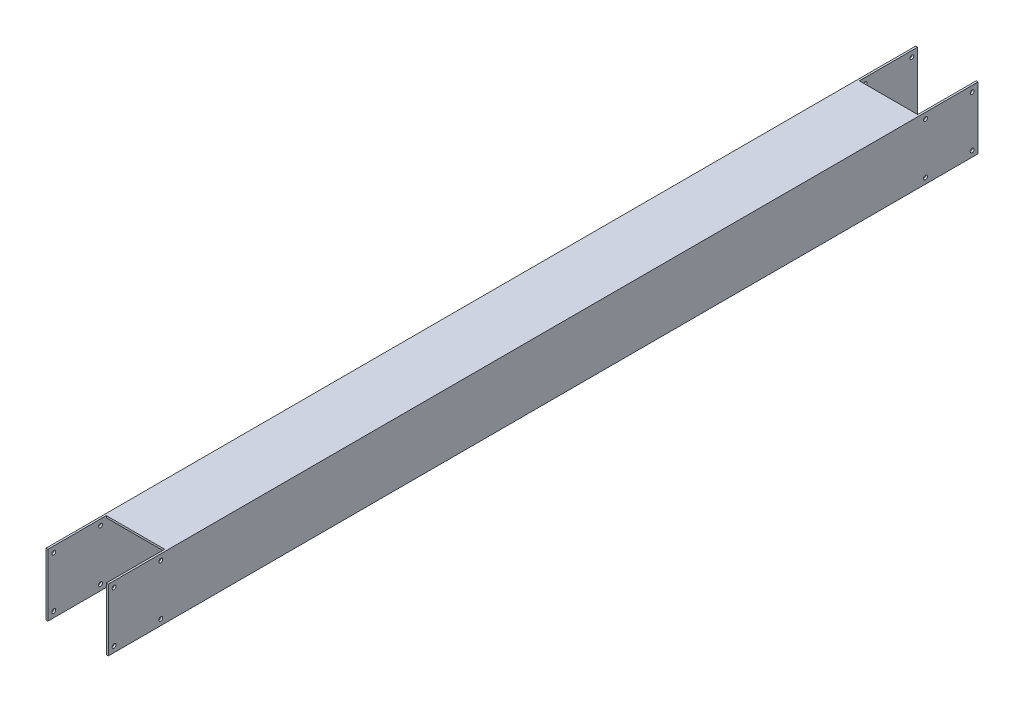
ISO-10303-21;
HEADER;
FILE_DESCRIPTION(('STEP AP214'),'2;1');
FILE_NAME('part.step','',(''),(''),'','','');
FILE_SCHEMA(('AUTOMOTIVE_DESIGN { 1 0 10303 214 1 1 1 1 }'));
ENDSEC;
DATA;
#1=APPLICATION_CONTEXT('core data for automotive mechanical design processes');
#2=APPLICATION_PROTOCOL_DEFINITION('international standard','automotive_design',2000,#1);
#3=PRODUCT_CONTEXT('',#1,'mechanical');
#4=PRODUCT('Part','Part','',(#3));
#5=PRODUCT_RELATED_PRODUCT_CATEGORY('part','',(#4));
#6=PRODUCT_DEFINITION_FORMATION('','',#4);
#7=PRODUCT_DEFINITION_CONTEXT('part definition',#1,'design');
#8=PRODUCT_DEFINITION('design','',#6,#7);
#9=PRODUCT_DEFINITION_SHAPE('','',#8);
#10=(LENGTH_UNIT() NAMED_UNIT(*) SI_UNIT(.MILLI.,.METRE.));
#11=(NAMED_UNIT(*) PLANE_ANGLE_UNIT() SI_UNIT($,.RADIAN.));
#12=(NAMED_UNIT(*) SI_UNIT($,.STERADIAN.) SOLID_ANGLE_UNIT());
#13=UNCERTAINTY_MEASURE_WITH_UNIT(LENGTH_MEASURE(1.E-05),#10,'distance_accuracy_value','');
#14=(GEOMETRIC_REPRESENTATION_CONTEXT(3) GLOBAL_UNCERTAINTY_ASSIGNED_CONTEXT((#13)) GLOBAL_UNIT_ASSIGNED_CONTEXT((#10,
#11,#12)) REPRESENTATION_CONTEXT('',''));
#15=CARTESIAN_POINT('',(0.,0.,0.));
#16=DIRECTION('',(0.,0.,1.));
#17=DIRECTION('',(1.,0.,0.));
#18=AXIS2_PLACEMENT_3D('',#15,#16,#17);
#19=CARTESIAN_POINT('',(-150.,-150.000000000001,4470.));
#20=DIRECTION('',(0.,1.,0.));
#21=DIRECTION('',(0.,0.,1.));
#22=AXIS2_PLACEMENT_3D('',#19,#20,#21);
#23=PLANE('',#22);
#24=DIRECTION('',(0.,0.,-1.));
#25=VECTOR('',#24,1.);
#26=CARTESIAN_POINT('',(150.,-150.000000000001,4470.));
#27=LINE('',#26,#25);
#28=CARTESIAN_POINT('',(150.,-150.000000000001,4170.));
#29=VERTEX_POINT('',#28);
#30=CARTESIAN_POINT('',(150.,-150.000000000001,300.));
#31=VERTEX_POINT('',#30);
#32=EDGE_CURVE('E335',#29,#31,#27,.T.);
#33=ORIENTED_EDGE('',*,*,#32,.T.);
#34=DIRECTION('',(-1.,0.,0.));
#35=VECTOR('',#34,1.);
#36=CARTESIAN_POINT('',(-150.,-150.000000000001,300.));
#37=LINE('',#36,#35);
#38=CARTESIAN_POINT('',(-150.,-150.000000000001,300.));
#39=VERTEX_POINT('',#38);
#40=EDGE_CURVE('E263',#31,#39,#37,.T.);
#41=ORIENTED_EDGE('',*,*,#40,.T.);
#42=DIRECTION('',(0.,0.,-1.));
#43=VECTOR('',#42,1.);
#44=CARTESIAN_POINT('',(-150.,-150.000000000001,4470.));
#45=LINE('',#44,#43);
#46=CARTESIAN_POINT('',(-150.,-150.000000000001,4170.));
#47=VERTEX_POINT('',#46);
#48=EDGE_CURVE('E185',#47,#39,#45,.T.);
#49=ORIENTED_EDGE('',*,*,#48,.F.);
#50=DIRECTION('',(1.,0.,0.));
#51=VECTOR('',#50,1.);
#52=CARTESIAN_POINT('',(-150.,-150.000000000001,4170.));
#53=LINE('',#52,#51);
#54=EDGE_CURVE('E306',#47,#29,#53,.T.);
#55=ORIENTED_EDGE('',*,*,#54,.T.);
#56=EDGE_LOOP('',(#33,#41,#49,#55));
#57=FACE_BOUND('',#56,.T.);
#58=ADVANCED_FACE('F39',(#57),#23,.T.);
#59=CARTESIAN_POINT('',(-150.,149.999999999999,4470.));
#60=DIRECTION('',(0.,-1.,0.));
#61=DIRECTION('',(0.,0.,-1.));
#62=AXIS2_PLACEMENT_3D('',#59,#60,#61);
#63=PLANE('',#62);
#64=DIRECTION('',(0.,0.,-1.));
#65=VECTOR('',#64,1.);
#66=CARTESIAN_POINT('',(-150.,149.999999999999,4470.));
#67=LINE('',#66,#65);
#68=CARTESIAN_POINT('',(-150.,149.999999999999,4170.));
#69=VERTEX_POINT('',#68);
#70=CARTESIAN_POINT('',(-150.,149.999999999999,300.));
#71=VERTEX_POINT('',#70);
#72=EDGE_CURVE('E327',#69,#71,#67,.T.);
#73=ORIENTED_EDGE('',*,*,#72,.T.);
#74=DIRECTION('',(1.,0.,0.));
#75=VECTOR('',#74,1.);
#76=CARTESIAN_POINT('',(-150.,149.999999999999,300.));
#77=LINE('',#76,#75);
#78=CARTESIAN_POINT('',(150.,149.999999999999,300.));
#79=VERTEX_POINT('',#78);
#80=EDGE_CURVE('E260',#71,#79,#77,.T.);
#81=ORIENTED_EDGE('',*,*,#80,.T.);
#82=DIRECTION('',(0.,0.,-1.));
#83=VECTOR('',#82,1.);
#84=CARTESIAN_POINT('',(150.,149.999999999999,4470.));
#85=LINE('',#84,#83);
#86=CARTESIAN_POINT('',(150.,149.999999999999,4170.));
#87=VERTEX_POINT('',#86);
#88=EDGE_CURVE('E332',#87,#79,#85,.T.);
#89=ORIENTED_EDGE('',*,*,#88,.F.);
#90=DIRECTION('',(-1.,0.,0.));
#91=VECTOR('',#90,1.);
#92=CARTESIAN_POINT('',(-150.,149.999999999999,4170.));
#93=LINE('',#92,#91);
#94=EDGE_CURVE('E206',#87,#69,#93,.T.);
#95=ORIENTED_EDGE('',*,*,#94,.T.);
#96=EDGE_LOOP('',(#73,#81,#89,#95));
#97=FACE_BOUND('',#96,.T.);
#98=ADVANCED_FACE('F375',(#97),#63,.T.);
#99=CARTESIAN_POINT('',(0.,0.,0.));
#100=DIRECTION('',(0.,0.,-1.));
#101=DIRECTION('',(-1.,0.,0.));
#102=AXIS2_PLACEMENT_3D('',#99,#100,#101);
#103=PLANE('',#102);
#104=DIRECTION('',(-1.,0.,0.));
#105=VECTOR('',#104,1.);
#106=CARTESIAN_POINT('',(-160.,159.999999999999,0.));
#107=LINE('',#106,#105);
#108=CARTESIAN_POINT('',(-150.,159.999999999999,0.));
#109=VERTEX_POINT('',#108);
#110=CARTESIAN_POINT('',(-160.,159.999999999999,0.));
#111=VERTEX_POINT('',#110);
#112=EDGE_CURVE('E170',#109,#111,#107,.T.);
#113=ORIENTED_EDGE('',*,*,#112,.F.);
#114=DIRECTION('',(0.,-1.,0.));
#115=VECTOR('',#114,1.);
#116=CARTESIAN_POINT('',(-150.,-150.000000000001,0.));
#117=LINE('',#116,#115);
#118=CARTESIAN_POINT('',(-150.,-160.000000000001,0.));
#119=VERTEX_POINT('',#118);
#120=EDGE_CURVE('E152',#109,#119,#117,.T.);
#121=ORIENTED_EDGE('',*,*,#120,.T.);
#122=DIRECTION('',(1.,0.,0.));
#123=VECTOR('',#122,1.);
#124=CARTESIAN_POINT('',(-160.,-160.000000000001,0.));
#125=LINE('',#124,#123);
#126=CARTESIAN_POINT('',(-160.,-160.000000000001,0.));
#127=VERTEX_POINT('',#126);
#128=EDGE_CURVE('E191',#127,#119,#125,.T.);
#129=ORIENTED_EDGE('',*,*,#128,.F.);
#130=DIRECTION('',(0.,-1.,0.));
#131=VECTOR('',#130,1.);
#132=CARTESIAN_POINT('',(-160.,-160.000000000001,0.));
#133=LINE('',#132,#131);
#134=EDGE_CURVE('E179',#111,#127,#133,.T.);
#135=ORIENTED_EDGE('',*,*,#134,.F.);
#136=EDGE_LOOP('',(#113,#121,#129,#135));
#137=FACE_BOUND('',#136,.T.);
#138=ADVANCED_FACE('F178',(#137),#103,.T.);
#139=CARTESIAN_POINT('',(150.,-160.000000000001,0.));
#140=VERTEX_POINT('',#139);
#141=CARTESIAN_POINT('',(160.,-160.000000000001,0.));
#142=VERTEX_POINT('',#141);
#143=EDGE_CURVE('E190',#140,#142,#125,.T.);
#144=ORIENTED_EDGE('',*,*,#143,.F.);
#145=DIRECTION('',(0.,1.,0.));
#146=VECTOR('',#145,1.);
#147=CARTESIAN_POINT('',(150.,-150.000000000001,0.));
#148=LINE('',#147,#146);
#149=CARTESIAN_POINT('',(150.,159.999999999999,0.));
#150=VERTEX_POINT('',#149);
#151=EDGE_CURVE('E164',#140,#150,#148,.T.);
#152=ORIENTED_EDGE('',*,*,#151,.T.);
#153=CARTESIAN_POINT('',(160.,159.999999999999,0.));
#154=VERTEX_POINT('',#153);
#155=EDGE_CURVE('E180',#154,#150,#107,.T.);
#156=ORIENTED_EDGE('',*,*,#155,.F.);
#157=DIRECTION('',(0.,1.,0.));
#158=VECTOR('',#157,1.);
#159=CARTESIAN_POINT('',(160.,-160.000000000001,0.));
#160=LINE('',#159,#158);
#161=EDGE_CURVE('E181',#142,#154,#160,.T.);
#162=ORIENTED_EDGE('',*,*,#161,.F.);
#163=EDGE_LOOP('',(#144,#152,#156,#162));
#164=FACE_BOUND('',#163,.T.);
#165=ADVANCED_FACE('F417',(#164),#103,.T.);
#166=CARTESIAN_POINT('',(-160.,159.999999999999,4470.));
#167=DIRECTION('',(0.,-1.,0.));
#168=DIRECTION('',(0.,0.,-1.));
#169=AXIS2_PLACEMENT_3D('',#166,#167,#168);
#170=PLANE('',#169);
#171=DIRECTION('',(0.,0.,1.));
#172=VECTOR('',#171,1.);
#173=CARTESIAN_POINT('',(-150.,159.999999999999,4470.));
#174=LINE('',#173,#172);
#175=CARTESIAN_POINT('',(-150.,159.999999999999,300.));
#176=VERTEX_POINT('',#175);
#177=EDGE_CURVE('E156',#109,#176,#174,.T.);
#178=ORIENTED_EDGE('',*,*,#177,.F.);
#179=ORIENTED_EDGE('',*,*,#112,.T.);
#180=DIRECTION('',(0.,0.,-1.));
#181=VECTOR('',#180,1.);
#182=CARTESIAN_POINT('',(-160.,159.999999999999,4470.));
#183=LINE('',#182,#181);
#184=CARTESIAN_POINT('',(-160.,159.999999999999,4470.));
#185=VERTEX_POINT('',#184);
#186=EDGE_CURVE('E201',#185,#111,#183,.T.);
#187=ORIENTED_EDGE('',*,*,#186,.F.);
#188=DIRECTION('',(-1.,0.,0.));
#189=VECTOR('',#188,1.);
#190=CARTESIAN_POINT('',(-160.,159.999999999999,4470.));
#191=LINE('',#190,#189);
#192=CARTESIAN_POINT('',(-150.,159.999999999999,4470.));
#193=VERTEX_POINT('',#192);
#194=EDGE_CURVE('E342',#193,#185,#191,.T.);
#195=ORIENTED_EDGE('',*,*,#194,.F.);
#196=DIRECTION('',(0.,0.,-1.));
#197=VECTOR('',#196,1.);
#198=CARTESIAN_POINT('',(-150.,159.999999999999,4470.));
#199=LINE('',#198,#197);
#200=CARTESIAN_POINT('',(-150.,159.999999999999,4170.));
#201=VERTEX_POINT('',#200);
#202=EDGE_CURVE('E165',#193,#201,#199,.T.);
#203=ORIENTED_EDGE('',*,*,#202,.T.);
#204=DIRECTION('',(-1.,0.,0.));
#205=VECTOR('',#204,1.);
#206=CARTESIAN_POINT('',(-160.,159.999999999999,4170.));
#207=LINE('',#206,#205);
#208=CARTESIAN_POINT('',(150.,159.999999999999,4170.));
#209=VERTEX_POINT('',#208);
#210=EDGE_CURVE('E311',#209,#201,#207,.T.);
#211=ORIENTED_EDGE('',*,*,#210,.F.);
#212=DIRECTION('',(0.,0.,1.));
#213=VECTOR('',#212,1.);
#214=CARTESIAN_POINT('',(150.,159.999999999999,4470.));
#215=LINE('',#214,#213);
#216=CARTESIAN_POINT('',(150.,159.999999999999,4470.));
#217=VERTEX_POINT('',#216);
#218=EDGE_CURVE('E316',#209,#217,#215,.T.);
#219=ORIENTED_EDGE('',*,*,#218,.T.);
#220=CARTESIAN_POINT('',(160.,159.999999999999,4470.));
#221=VERTEX_POINT('',#220);
#222=EDGE_CURVE('E343',#221,#217,#191,.T.);
#223=ORIENTED_EDGE('',*,*,#222,.F.);
#224=DIRECTION('',(0.,0.,-1.));
#225=VECTOR('',#224,1.);
#226=CARTESIAN_POINT('',(160.,159.999999999999,4470.));
#227=LINE('',#226,#225);
#228=EDGE_CURVE('E203',#221,#154,#227,.T.);
#229=ORIENTED_EDGE('',*,*,#228,.T.);
#230=ORIENTED_EDGE('',*,*,#155,.T.);
#231=DIRECTION('',(0.,0.,-1.));
#232=VECTOR('',#231,1.);
#233=CARTESIAN_POINT('',(150.,159.999999999999,4470.));
#234=LINE('',#233,#232);
#235=CARTESIAN_POINT('',(150.,159.999999999999,300.));
#236=VERTEX_POINT('',#235);
#237=EDGE_CURVE('E175',#236,#150,#234,.T.);
#238=ORIENTED_EDGE('',*,*,#237,.F.);
#239=DIRECTION('',(1.,0.,0.));
#240=VECTOR('',#239,1.);
#241=CARTESIAN_POINT('',(-160.,159.999999999999,300.));
#242=LINE('',#241,#240);
#243=EDGE_CURVE('E173',#176,#236,#242,.T.);
#244=ORIENTED_EDGE('',*,*,#243,.F.);
#245=EDGE_LOOP('',(#178,#179,#187,#195,#203,#211,#219,#223,#229,#230,#238,#244));
#246=FACE_BOUND('',#245,.T.);
#247=ADVANCED_FACE('F168',(#246),#170,.F.);
#248=CARTESIAN_POINT('',(-160.,-160.000000000001,4470.));
#249=DIRECTION('',(0.,1.,0.));
#250=DIRECTION('',(0.,0.,1.));
#251=AXIS2_PLACEMENT_3D('',#248,#249,#250);
#252=PLANE('',#251);
#253=DIRECTION('',(0.,0.,-1.));
#254=VECTOR('',#253,1.);
#255=CARTESIAN_POINT('',(-150.,-160.000000000001,4470.));
#256=LINE('',#255,#254);
#257=CARTESIAN_POINT('',(-150.,-160.000000000001,300.));
#258=VERTEX_POINT('',#257);
#259=EDGE_CURVE('E11',#258,#119,#256,.T.);
#260=ORIENTED_EDGE('',*,*,#259,.F.);
#261=DIRECTION('',(-1.,0.,0.));
#262=VECTOR('',#261,1.);
#263=CARTESIAN_POINT('',(-160.,-160.000000000001,300.));
#264=LINE('',#263,#262);
#265=CARTESIAN_POINT('',(150.,-160.000000000001,300.));
#266=VERTEX_POINT('',#265);
#267=EDGE_CURVE('E257',#266,#258,#264,.T.);
#268=ORIENTED_EDGE('',*,*,#267,.F.);
#269=DIRECTION('',(0.,0.,1.));
#270=VECTOR('',#269,1.);
#271=CARTESIAN_POINT('',(150.,-160.000000000001,4470.));
#272=LINE('',#271,#270);
#273=EDGE_CURVE('E48',#140,#266,#272,.T.);
#274=ORIENTED_EDGE('',*,*,#273,.F.);
#275=ORIENTED_EDGE('',*,*,#143,.T.);
#276=DIRECTION('',(0.,0.,-1.));
#277=VECTOR('',#276,1.);
#278=CARTESIAN_POINT('',(160.,-160.000000000001,4470.));
#279=LINE('',#278,#277);
#280=CARTESIAN_POINT('',(160.,-160.000000000001,4470.));
#281=VERTEX_POINT('',#280);
#282=EDGE_CURVE('E194',#281,#142,#279,.T.);
#283=ORIENTED_EDGE('',*,*,#282,.F.);
#284=DIRECTION('',(1.,0.,0.));
#285=VECTOR('',#284,1.);
#286=CARTESIAN_POINT('',(-160.,-160.000000000001,4470.));
#287=LINE('',#286,#285);
#288=CARTESIAN_POINT('',(150.,-160.000000000001,4470.));
#289=VERTEX_POINT('',#288);
#290=EDGE_CURVE('E347',#289,#281,#287,.T.);
#291=ORIENTED_EDGE('',*,*,#290,.F.);
#292=DIRECTION('',(0.,0.,-1.));
#293=VECTOR('',#292,1.);
#294=CARTESIAN_POINT('',(150.,-160.000000000001,4470.));
#295=LINE('',#294,#293);
#296=CARTESIAN_POINT('',(150.,-160.000000000001,4170.));
#297=VERTEX_POINT('',#296);
#298=EDGE_CURVE('E313',#289,#297,#295,.T.);
#299=ORIENTED_EDGE('',*,*,#298,.T.);
#300=DIRECTION('',(1.,0.,0.));
#301=VECTOR('',#300,1.);
#302=CARTESIAN_POINT('',(-160.,-160.000000000001,4170.));
#303=LINE('',#302,#301);
#304=CARTESIAN_POINT('',(-150.,-160.000000000001,4170.));
#305=VERTEX_POINT('',#304);
#306=EDGE_CURVE('E309',#305,#297,#303,.T.);
#307=ORIENTED_EDGE('',*,*,#306,.F.);
#308=DIRECTION('',(0.,0.,1.));
#309=VECTOR('',#308,1.);
#310=CARTESIAN_POINT('',(-150.,-160.000000000001,4470.));
#311=LINE('',#310,#309);
#312=CARTESIAN_POINT('',(-150.,-160.000000000001,4470.));
#313=VERTEX_POINT('',#312);
#314=EDGE_CURVE('E319',#305,#313,#311,.T.);
#315=ORIENTED_EDGE('',*,*,#314,.T.);
#316=CARTESIAN_POINT('',(-160.,-160.000000000001,4470.));
#317=VERTEX_POINT('',#316);
#318=EDGE_CURVE('E198',#317,#313,#287,.T.);
#319=ORIENTED_EDGE('',*,*,#318,.F.);
#320=DIRECTION('',(0.,0.,-1.));
#321=VECTOR('',#320,1.);
#322=CARTESIAN_POINT('',(-160.,-160.000000000001,4470.));
#323=LINE('',#322,#321);
#324=EDGE_CURVE('E197',#317,#127,#323,.T.);
#325=ORIENTED_EDGE('',*,*,#324,.T.);
#326=ORIENTED_EDGE('',*,*,#128,.T.);
#327=EDGE_LOOP('',(#260,#268,#274,#275,#283,#291,#299,#307,#315,#319,#325,#326));
#328=FACE_BOUND('',#327,.T.);
#329=ADVANCED_FACE('F359',(#328),#252,.F.);
#330=CARTESIAN_POINT('',(0.,0.,4470.));
#331=DIRECTION('',(0.,0.,-1.));
#332=DIRECTION('',(-1.,0.,0.));
#333=AXIS2_PLACEMENT_3D('',#330,#331,#332);
#334=PLANE('',#333);
#335=ORIENTED_EDGE('',*,*,#318,.T.);
#336=DIRECTION('',(0.,-1.,0.));
#337=VECTOR('',#336,1.);
#338=CARTESIAN_POINT('',(-150.,-150.000000000001,4470.));
#339=LINE('',#338,#337);
#340=EDGE_CURVE('E324',#193,#313,#339,.T.);
#341=ORIENTED_EDGE('',*,*,#340,.F.);
#342=ORIENTED_EDGE('',*,*,#194,.T.);
#343=DIRECTION('',(0.,-1.,0.));
#344=VECTOR('',#343,1.);
#345=CARTESIAN_POINT('',(-160.,-160.000000000001,4470.));
#346=LINE('',#345,#344);
#347=EDGE_CURVE('E346',#185,#317,#346,.T.);
#348=ORIENTED_EDGE('',*,*,#347,.T.);
#349=EDGE_LOOP('',(#335,#341,#342,#348));
#350=FACE_BOUND('',#349,.T.);
#351=ADVANCED_FACE('F379',(#350),#334,.F.);
#352=ORIENTED_EDGE('',*,*,#222,.T.);
#353=DIRECTION('',(0.,1.,0.));
#354=VECTOR('',#353,1.);
#355=CARTESIAN_POINT('',(150.,-150.000000000001,4470.));
#356=LINE('',#355,#354);
#357=EDGE_CURVE('E326',#289,#217,#356,.T.);
#358=ORIENTED_EDGE('',*,*,#357,.F.);
#359=ORIENTED_EDGE('',*,*,#290,.T.);
#360=DIRECTION('',(0.,1.,0.));
#361=VECTOR('',#360,1.);
#362=CARTESIAN_POINT('',(160.,-160.000000000001,4470.));
#363=LINE('',#362,#361);
#364=EDGE_CURVE('E193',#281,#221,#363,.T.);
#365=ORIENTED_EDGE('',*,*,#364,.T.);
#366=EDGE_LOOP('',(#352,#358,#359,#365));
#367=FACE_BOUND('',#366,.T.);
#368=ADVANCED_FACE('F354',(#367),#334,.F.);
#369=CARTESIAN_POINT('',(160.,-160.000000000001,4470.));
#370=DIRECTION('',(-1.,0.,0.));
#371=DIRECTION('',(0.,0.,1.));
#372=AXIS2_PLACEMENT_3D('',#369,#370,#371);
#373=PLANE('',#372);
#374=CARTESIAN_POINT('',(160.,-130.000000000001,30.0000000000002));
#375=DIRECTION('',(-1.,0.,0.));
#376=DIRECTION('',(0.,0.,1.));
#377=AXIS2_PLACEMENT_3D('',#374,#375,#376);
#378=CIRCLE('',#377,9.99999999999964);
#379=CARTESIAN_POINT('',(160.,-130.000000000001,39.9999999999999));
#380=VERTEX_POINT('',#379);
#381=EDGE_CURVE('E490',#380,#380,#378,.T.);
#382=ORIENTED_EDGE('',*,*,#381,.T.);
#383=EDGE_LOOP('',(#382));
#384=FACE_BOUND('',#383,.T.);
#385=CARTESIAN_POINT('',(160.,-130.000000000001,270.));
#386=DIRECTION('',(-1.,0.,0.));
#387=DIRECTION('',(0.,0.,1.));
#388=AXIS2_PLACEMENT_3D('',#385,#386,#387);
#389=CIRCLE('',#388,9.99999999999964);
#390=CARTESIAN_POINT('',(160.,-130.000000000001,279.999999999999));
#391=VERTEX_POINT('',#390);
#392=EDGE_CURVE('E496',#391,#391,#389,.T.);
#393=ORIENTED_EDGE('',*,*,#392,.T.);
#394=EDGE_LOOP('',(#393));
#395=FACE_BOUND('',#394,.T.);
#396=CARTESIAN_POINT('',(160.,129.999999999999,270.));
#397=DIRECTION('',(-1.,0.,0.));
#398=DIRECTION('',(0.,0.,1.));
#399=AXIS2_PLACEMENT_3D('',#396,#397,#398);
#400=CIRCLE('',#399,9.99999999999964);
#401=CARTESIAN_POINT('',(160.,129.999999999999,279.999999999999));
#402=VERTEX_POINT('',#401);
#403=EDGE_CURVE('E487',#402,#402,#400,.T.);
#404=ORIENTED_EDGE('',*,*,#403,.T.);
#405=EDGE_LOOP('',(#404));
#406=FACE_BOUND('',#405,.T.);
#407=CARTESIAN_POINT('',(160.,129.999999999999,30.0000000000002));
#408=DIRECTION('',(-1.,0.,0.));
#409=DIRECTION('',(0.,0.,1.));
#410=AXIS2_PLACEMENT_3D('',#407,#408,#409);
#411=CIRCLE('',#410,9.99999999999964);
#412=CARTESIAN_POINT('',(160.,129.999999999999,39.9999999999999));
#413=VERTEX_POINT('',#412);
#414=EDGE_CURVE('E481',#413,#413,#411,.T.);
#415=ORIENTED_EDGE('',*,*,#414,.T.);
#416=EDGE_LOOP('',(#415));
#417=FACE_BOUND('',#416,.T.);
#418=CARTESIAN_POINT('',(160.,-130.000000000001,4440.));
#419=DIRECTION('',(1.,0.,0.));
#420=DIRECTION('',(0.,0.,-1.));
#421=AXIS2_PLACEMENT_3D('',#418,#419,#420);
#422=CIRCLE('',#421,9.99999999999964);
#423=CARTESIAN_POINT('',(160.,-130.000000000001,4430.));
#424=VERTEX_POINT('',#423);
#425=EDGE_CURVE('E174',#424,#424,#422,.T.);
#426=ORIENTED_EDGE('',*,*,#425,.F.);
#427=EDGE_LOOP('',(#426));
#428=FACE_BOUND('',#427,.T.);
#429=CARTESIAN_POINT('',(160.,-130.000000000001,4200.));
#430=DIRECTION('',(1.,0.,0.));
#431=DIRECTION('',(0.,0.,-1.));
#432=AXIS2_PLACEMENT_3D('',#429,#430,#431);
#433=CIRCLE('',#432,9.99999999999964);
#434=CARTESIAN_POINT('',(160.,-130.000000000001,4190.));
#435=VERTEX_POINT('',#434);
#436=EDGE_CURVE('E278',#435,#435,#433,.T.);
#437=ORIENTED_EDGE('',*,*,#436,.F.);
#438=EDGE_LOOP('',(#437));
#439=FACE_BOUND('',#438,.T.);
#440=CARTESIAN_POINT('',(160.,129.999999999999,4200.));
#441=DIRECTION('',(1.,0.,0.));
#442=DIRECTION('',(0.,0.,-1.));
#443=AXIS2_PLACEMENT_3D('',#440,#441,#442);
#444=CIRCLE('',#443,9.99999999999964);
#445=CARTESIAN_POINT('',(160.,129.999999999999,4190.));
#446=VERTEX_POINT('',#445);
#447=EDGE_CURVE('E272',#446,#446,#444,.T.);
#448=ORIENTED_EDGE('',*,*,#447,.F.);
#449=EDGE_LOOP('',(#448));
#450=FACE_BOUND('',#449,.T.);
#451=CARTESIAN_POINT('',(160.,129.999999999999,4440.));
#452=DIRECTION('',(1.,0.,0.));
#453=DIRECTION('',(0.,0.,-1.));
#454=AXIS2_PLACEMENT_3D('',#451,#452,#453);
#455=CIRCLE('',#454,9.99999999999964);
#456=CARTESIAN_POINT('',(160.,129.999999999999,4430.));
#457=VERTEX_POINT('',#456);
#458=EDGE_CURVE('E271',#457,#457,#455,.T.);
#459=ORIENTED_EDGE('',*,*,#458,.F.);
#460=EDGE_LOOP('',(#459));
#461=FACE_BOUND('',#460,.T.);
#462=ORIENTED_EDGE('',*,*,#161,.T.);
#463=ORIENTED_EDGE('',*,*,#228,.F.);
#464=ORIENTED_EDGE('',*,*,#364,.F.);
#465=ORIENTED_EDGE('',*,*,#282,.T.);
#466=EDGE_LOOP('',(#462,#463,#464,#465));
#467=FACE_BOUND('',#466,.T.);
#468=ADVANCED_FACE('F41',(#384,#395,#406,#417,#428,#439,#450,#461,#467),#373,.F.);
#469=CARTESIAN_POINT('',(-160.,-160.000000000001,4470.));
#470=DIRECTION('',(1.,0.,0.));
#471=DIRECTION('',(0.,0.,-1.));
#472=AXIS2_PLACEMENT_3D('',#469,#470,#471);
#473=PLANE('',#472);
#474=CARTESIAN_POINT('',(-160.,-130.000000000001,30.0000000000002));
#475=DIRECTION('',(-1.,0.,0.));
#476=DIRECTION('',(0.,0.,1.));
#477=AXIS2_PLACEMENT_3D('',#474,#475,#476);
#478=CIRCLE('',#477,9.99999999999964);
#479=CARTESIAN_POINT('',(-160.,-130.000000000001,39.9999999999999));
#480=VERTEX_POINT('',#479);
#481=EDGE_CURVE('E493',#480,#480,#478,.T.);
#482=ORIENTED_EDGE('',*,*,#481,.F.);
#483=EDGE_LOOP('',(#482));
#484=FACE_BOUND('',#483,.T.);
#485=CARTESIAN_POINT('',(-160.,-130.000000000001,270.));
#486=DIRECTION('',(-1.,0.,0.));
#487=DIRECTION('',(0.,0.,1.));
#488=AXIS2_PLACEMENT_3D('',#485,#486,#487);
#489=CIRCLE('',#488,9.99999999999964);
#490=CARTESIAN_POINT('',(-160.,-130.000000000001,279.999999999999));
#491=VERTEX_POINT('',#490);
#492=EDGE_CURVE('E499',#491,#491,#489,.T.);
#493=ORIENTED_EDGE('',*,*,#492,.F.);
#494=EDGE_LOOP('',(#493));
#495=FACE_BOUND('',#494,.T.);
#496=CARTESIAN_POINT('',(-160.,129.999999999999,270.));
#497=DIRECTION('',(-1.,0.,0.));
#498=DIRECTION('',(0.,0.,1.));
#499=AXIS2_PLACEMENT_3D('',#496,#497,#498);
#500=CIRCLE('',#499,9.99999999999964);
#501=CARTESIAN_POINT('',(-160.,129.999999999999,279.999999999999));
#502=VERTEX_POINT('',#501);
#503=EDGE_CURVE('E483',#502,#502,#500,.T.);
#504=ORIENTED_EDGE('',*,*,#503,.F.);
#505=EDGE_LOOP('',(#504));
#506=FACE_BOUND('',#505,.T.);
#507=CARTESIAN_POINT('',(-160.,129.999999999999,30.0000000000002));
#508=DIRECTION('',(-1.,0.,0.));
#509=DIRECTION('',(0.,0.,1.));
#510=AXIS2_PLACEMENT_3D('',#507,#508,#509);
#511=CIRCLE('',#510,9.99999999999964);
#512=CARTESIAN_POINT('',(-160.,129.999999999999,39.9999999999999));
#513=VERTEX_POINT('',#512);
#514=EDGE_CURVE('E231',#513,#513,#511,.T.);
#515=ORIENTED_EDGE('',*,*,#514,.F.);
#516=EDGE_LOOP('',(#515));
#517=FACE_BOUND('',#516,.T.);
#518=CARTESIAN_POINT('',(-160.,-130.000000000001,4440.));
#519=DIRECTION('',(1.,0.,0.));
#520=DIRECTION('',(0.,0.,-1.));
#521=AXIS2_PLACEMENT_3D('',#518,#519,#520);
#522=CIRCLE('',#521,9.99999999999964);
#523=CARTESIAN_POINT('',(-160.,-130.000000000001,4430.));
#524=VERTEX_POINT('',#523);
#525=EDGE_CURVE('E281',#524,#524,#522,.T.);
#526=ORIENTED_EDGE('',*,*,#525,.T.);
#527=EDGE_LOOP('',(#526));
#528=FACE_BOUND('',#527,.T.);
#529=CARTESIAN_POINT('',(-160.,-130.000000000001,4200.));
#530=DIRECTION('',(1.,0.,0.));
#531=DIRECTION('',(0.,0.,-1.));
#532=AXIS2_PLACEMENT_3D('',#529,#530,#531);
#533=CIRCLE('',#532,9.99999999999964);
#534=CARTESIAN_POINT('',(-160.,-130.000000000001,4190.));
#535=VERTEX_POINT('',#534);
#536=EDGE_CURVE('E275',#535,#535,#533,.T.);
#537=ORIENTED_EDGE('',*,*,#536,.T.);
#538=EDGE_LOOP('',(#537));
#539=FACE_BOUND('',#538,.T.);
#540=CARTESIAN_POINT('',(-160.,129.999999999999,4200.));
#541=DIRECTION('',(1.,0.,0.));
#542=DIRECTION('',(0.,0.,-1.));
#543=AXIS2_PLACEMENT_3D('',#540,#541,#542);
#544=CIRCLE('',#543,9.99999999999964);
#545=CARTESIAN_POINT('',(-160.,129.999999999999,4190.));
#546=VERTEX_POINT('',#545);
#547=EDGE_CURVE('E268',#546,#546,#544,.T.);
#548=ORIENTED_EDGE('',*,*,#547,.T.);
#549=EDGE_LOOP('',(#548));
#550=FACE_BOUND('',#549,.T.);
#551=CARTESIAN_POINT('',(-160.,129.999999999999,4440.));
#552=DIRECTION('',(1.,0.,0.));
#553=DIRECTION('',(0.,0.,-1.));
#554=AXIS2_PLACEMENT_3D('',#551,#552,#553);
#555=CIRCLE('',#554,9.99999999999964);
#556=CARTESIAN_POINT('',(-160.,129.999999999999,4430.));
#557=VERTEX_POINT('',#556);
#558=EDGE_CURVE('E213',#557,#557,#555,.T.);
#559=ORIENTED_EDGE('',*,*,#558,.T.);
#560=EDGE_LOOP('',(#559));
#561=FACE_BOUND('',#560,.T.);
#562=ORIENTED_EDGE('',*,*,#134,.T.);
#563=ORIENTED_EDGE('',*,*,#324,.F.);
#564=ORIENTED_EDGE('',*,*,#347,.F.);
#565=ORIENTED_EDGE('',*,*,#186,.T.);
#566=EDGE_LOOP('',(#562,#563,#564,#565));
#567=FACE_BOUND('',#566,.T.);
#568=ADVANCED_FACE('F391',(#484,#495,#506,#517,#528,#539,#550,#561,#567),#473,.F.);
#569=CARTESIAN_POINT('',(-150.,-150.000000000001,4470.));
#570=DIRECTION('',(1.,0.,0.));
#571=DIRECTION('',(0.,0.,-1.));
#572=AXIS2_PLACEMENT_3D('',#569,#570,#571);
#573=PLANE('',#572);
#574=CARTESIAN_POINT('',(-150.,-130.000000000001,30.0000000000002));
#575=DIRECTION('',(1.,0.,0.));
#576=DIRECTION('',(0.,0.,-1.));
#577=AXIS2_PLACEMENT_3D('',#574,#575,#576);
#578=CIRCLE('',#577,9.99999999999964);
#579=CARTESIAN_POINT('',(-150.,-130.000000000001,20.0000000000006));
#580=VERTEX_POINT('',#579);
#581=EDGE_CURVE('E249',#580,#580,#578,.F.);
#582=ORIENTED_EDGE('',*,*,#581,.T.);
#583=EDGE_LOOP('',(#582));
#584=FACE_BOUND('',#583,.T.);
#585=CARTESIAN_POINT('',(-150.,-130.000000000001,270.));
#586=DIRECTION('',(1.,0.,0.));
#587=DIRECTION('',(0.,0.,-1.));
#588=AXIS2_PLACEMENT_3D('',#585,#586,#587);
#589=CIRCLE('',#588,9.99999999999964);
#590=CARTESIAN_POINT('',(-150.,-130.000000000001,260.));
#591=VERTEX_POINT('',#590);
#592=EDGE_CURVE('E237',#591,#591,#589,.F.);
#593=ORIENTED_EDGE('',*,*,#592,.T.);
#594=EDGE_LOOP('',(#593));
#595=FACE_BOUND('',#594,.T.);
#596=CARTESIAN_POINT('',(-150.,129.999999999999,270.));
#597=DIRECTION('',(1.,0.,0.));
#598=DIRECTION('',(0.,0.,-1.));
#599=AXIS2_PLACEMENT_3D('',#596,#597,#598);
#600=CIRCLE('',#599,9.99999999999964);
#601=CARTESIAN_POINT('',(-150.,129.999999999999,260.));
#602=VERTEX_POINT('',#601);
#603=EDGE_CURVE('E234',#602,#602,#600,.F.);
#604=ORIENTED_EDGE('',*,*,#603,.T.);
#605=EDGE_LOOP('',(#604));
#606=FACE_BOUND('',#605,.T.);
#607=CARTESIAN_POINT('',(-150.,129.999999999999,30.0000000000002));
#608=DIRECTION('',(1.,0.,0.));
#609=DIRECTION('',(0.,0.,-1.));
#610=AXIS2_PLACEMENT_3D('',#607,#608,#609);
#611=CIRCLE('',#610,9.99999999999964);
#612=CARTESIAN_POINT('',(-150.,129.999999999999,20.0000000000006));
#613=VERTEX_POINT('',#612);
#614=EDGE_CURVE('E230',#613,#613,#611,.F.);
#615=ORIENTED_EDGE('',*,*,#614,.T.);
#616=EDGE_LOOP('',(#615));
#617=FACE_BOUND('',#616,.T.);
#618=ORIENTED_EDGE('',*,*,#120,.F.);
#619=ORIENTED_EDGE('',*,*,#177,.T.);
#620=DIRECTION('',(0.,-1.,0.));
#621=VECTOR('',#620,1.);
#622=CARTESIAN_POINT('',(-150.,-184.533187540373,300.));
#623=LINE('',#622,#621);
#624=EDGE_CURVE('E56',#176,#71,#623,.T.);
#625=ORIENTED_EDGE('',*,*,#624,.T.);
#626=ORIENTED_EDGE('',*,*,#72,.F.);
#627=DIRECTION('',(0.,-1.,0.));
#628=VECTOR('',#627,1.);
#629=CARTESIAN_POINT('',(-150.,-184.533187540373,4170.));
#630=LINE('',#629,#628);
#631=EDGE_CURVE('E301',#201,#69,#630,.T.);
#632=ORIENTED_EDGE('',*,*,#631,.F.);
#633=ORIENTED_EDGE('',*,*,#202,.F.);
#634=ORIENTED_EDGE('',*,*,#340,.T.);
#635=ORIENTED_EDGE('',*,*,#314,.F.);
#636=EDGE_CURVE('E298',#47,#305,#630,.T.);
#637=ORIENTED_EDGE('',*,*,#636,.F.);
#638=ORIENTED_EDGE('',*,*,#48,.T.);
#639=EDGE_CURVE('E252',#39,#258,#623,.T.);
#640=ORIENTED_EDGE('',*,*,#639,.T.);
#641=ORIENTED_EDGE('',*,*,#259,.T.);
#642=EDGE_LOOP('',(#618,#619,#625,#626,#632,#633,#634,#635,#637,#638,#640,#641));
#643=FACE_BOUND('',#642,.T.);
#644=CARTESIAN_POINT('',(-150.,-130.000000000001,4440.));
#645=DIRECTION('',(1.,0.,0.));
#646=DIRECTION('',(0.,0.,-1.));
#647=AXIS2_PLACEMENT_3D('',#644,#645,#646);
#648=CIRCLE('',#647,9.99999999999964);
#649=CARTESIAN_POINT('',(-150.,-130.000000000001,4430.));
#650=VERTEX_POINT('',#649);
#651=EDGE_CURVE('E225',#650,#650,#648,.T.);
#652=ORIENTED_EDGE('',*,*,#651,.F.);
#653=EDGE_LOOP('',(#652));
#654=FACE_BOUND('',#653,.T.);
#655=CARTESIAN_POINT('',(-150.,-130.000000000001,4200.));
#656=DIRECTION('',(1.,0.,0.));
#657=DIRECTION('',(0.,0.,-1.));
#658=AXIS2_PLACEMENT_3D('',#655,#656,#657);
#659=CIRCLE('',#658,9.99999999999964);
#660=CARTESIAN_POINT('',(-150.,-130.000000000001,4190.));
#661=VERTEX_POINT('',#660);
#662=EDGE_CURVE('E221',#661,#661,#659,.T.);
#663=ORIENTED_EDGE('',*,*,#662,.F.);
#664=EDGE_LOOP('',(#663));
#665=FACE_BOUND('',#664,.T.);
#666=CARTESIAN_POINT('',(-150.,129.999999999999,4200.));
#667=DIRECTION('',(1.,0.,0.));
#668=DIRECTION('',(0.,0.,-1.));
#669=AXIS2_PLACEMENT_3D('',#666,#667,#668);
#670=CIRCLE('',#669,9.99999999999964);
#671=CARTESIAN_POINT('',(-150.,129.999999999999,4190.));
#672=VERTEX_POINT('',#671);
#673=EDGE_CURVE('E217',#672,#672,#670,.T.);
#674=ORIENTED_EDGE('',*,*,#673,.F.);
#675=EDGE_LOOP('',(#674));
#676=FACE_BOUND('',#675,.T.);
#677=CARTESIAN_POINT('',(-150.,129.999999999999,4440.));
#678=DIRECTION('',(1.,0.,0.));
#679=DIRECTION('',(0.,0.,-1.));
#680=AXIS2_PLACEMENT_3D('',#677,#678,#679);
#681=CIRCLE('',#680,9.99999999999964);
#682=CARTESIAN_POINT('',(-150.,129.999999999999,4430.));
#683=VERTEX_POINT('',#682);
#684=EDGE_CURVE('E212',#683,#683,#681,.T.);
#685=ORIENTED_EDGE('',*,*,#684,.F.);
#686=EDGE_LOOP('',(#685));
#687=FACE_BOUND('',#686,.T.);
#688=ADVANCED_FACE('F154',(#584,#595,#606,#617,#643,#654,#665,#676,#687),#573,.T.);
#689=CARTESIAN_POINT('',(150.,-150.000000000001,4470.));
#690=DIRECTION('',(-1.,0.,0.));
#691=DIRECTION('',(0.,0.,1.));
#692=AXIS2_PLACEMENT_3D('',#689,#690,#691);
#693=PLANE('',#692);
#694=CARTESIAN_POINT('',(150.,-130.000000000001,30.0000000000002));
#695=DIRECTION('',(-1.,0.,0.));
#696=DIRECTION('',(0.,0.,1.));
#697=AXIS2_PLACEMENT_3D('',#694,#695,#696);
#698=CIRCLE('',#697,9.99999999999964);
#699=CARTESIAN_POINT('',(150.,-130.000000000001,39.9999999999999));
#700=VERTEX_POINT('',#699);
#701=EDGE_CURVE('E43',#700,#700,#698,.F.);
#702=ORIENTED_EDGE('',*,*,#701,.T.);
#703=EDGE_LOOP('',(#702));
#704=FACE_BOUND('',#703,.T.);
#705=CARTESIAN_POINT('',(150.,-130.000000000001,270.));
#706=DIRECTION('',(-1.,0.,0.));
#707=DIRECTION('',(0.,0.,1.));
#708=AXIS2_PLACEMENT_3D('',#705,#706,#707);
#709=CIRCLE('',#708,9.99999999999964);
#710=CARTESIAN_POINT('',(150.,-130.000000000001,279.999999999999));
#711=VERTEX_POINT('',#710);
#712=EDGE_CURVE('E235',#711,#711,#709,.F.);
#713=ORIENTED_EDGE('',*,*,#712,.T.);
#714=EDGE_LOOP('',(#713));
#715=FACE_BOUND('',#714,.T.);
#716=CARTESIAN_POINT('',(150.,129.999999999999,270.));
#717=DIRECTION('',(-1.,0.,0.));
#718=DIRECTION('',(0.,0.,1.));
#719=AXIS2_PLACEMENT_3D('',#716,#717,#718);
#720=CIRCLE('',#719,9.99999999999964);
#721=CARTESIAN_POINT('',(150.,129.999999999999,279.999999999999));
#722=VERTEX_POINT('',#721);
#723=EDGE_CURVE('E232',#722,#722,#720,.F.);
#724=ORIENTED_EDGE('',*,*,#723,.T.);
#725=EDGE_LOOP('',(#724));
#726=FACE_BOUND('',#725,.T.);
#727=CARTESIAN_POINT('',(150.,129.999999999999,30.0000000000002));
#728=DIRECTION('',(-1.,0.,0.));
#729=DIRECTION('',(0.,0.,1.));
#730=AXIS2_PLACEMENT_3D('',#727,#728,#729);
#731=CIRCLE('',#730,9.99999999999964);
#732=CARTESIAN_POINT('',(150.,129.999999999999,39.9999999999999));
#733=VERTEX_POINT('',#732);
#734=EDGE_CURVE('E227',#733,#733,#731,.F.);
#735=ORIENTED_EDGE('',*,*,#734,.T.);
#736=EDGE_LOOP('',(#735));
#737=FACE_BOUND('',#736,.T.);
#738=ORIENTED_EDGE('',*,*,#151,.F.);
#739=ORIENTED_EDGE('',*,*,#273,.T.);
#740=DIRECTION('',(0.,1.,0.));
#741=VECTOR('',#740,1.);
#742=CARTESIAN_POINT('',(150.,-184.533187540373,300.));
#743=LINE('',#742,#741);
#744=EDGE_CURVE('E64',#266,#31,#743,.T.);
#745=ORIENTED_EDGE('',*,*,#744,.T.);
#746=ORIENTED_EDGE('',*,*,#32,.F.);
#747=DIRECTION('',(0.,1.,0.));
#748=VECTOR('',#747,1.);
#749=CARTESIAN_POINT('',(150.,-184.533187540373,4170.));
#750=LINE('',#749,#748);
#751=EDGE_CURVE('E305',#297,#29,#750,.T.);
#752=ORIENTED_EDGE('',*,*,#751,.F.);
#753=ORIENTED_EDGE('',*,*,#298,.F.);
#754=ORIENTED_EDGE('',*,*,#357,.T.);
#755=ORIENTED_EDGE('',*,*,#218,.F.);
#756=EDGE_CURVE('E302',#87,#209,#750,.T.);
#757=ORIENTED_EDGE('',*,*,#756,.F.);
#758=ORIENTED_EDGE('',*,*,#88,.T.);
#759=EDGE_CURVE('E254',#79,#236,#743,.T.);
#760=ORIENTED_EDGE('',*,*,#759,.T.);
#761=ORIENTED_EDGE('',*,*,#237,.T.);
#762=EDGE_LOOP('',(#738,#739,#745,#746,#752,#753,#754,#755,#757,#758,#760,#761));
#763=FACE_BOUND('',#762,.T.);
#764=CARTESIAN_POINT('',(150.,-130.000000000001,4440.));
#765=DIRECTION('',(-1.,0.,0.));
#766=DIRECTION('',(0.,0.,1.));
#767=AXIS2_PLACEMENT_3D('',#764,#765,#766);
#768=CIRCLE('',#767,9.99999999999964);
#769=CARTESIAN_POINT('',(150.,-130.000000000001,4450.));
#770=VERTEX_POINT('',#769);
#771=EDGE_CURVE('E222',#770,#770,#768,.T.);
#772=ORIENTED_EDGE('',*,*,#771,.F.);
#773=EDGE_LOOP('',(#772));
#774=FACE_BOUND('',#773,.T.);
#775=CARTESIAN_POINT('',(150.,-130.000000000001,4200.));
#776=DIRECTION('',(-1.,0.,0.));
#777=DIRECTION('',(0.,0.,1.));
#778=AXIS2_PLACEMENT_3D('',#775,#776,#777);
#779=CIRCLE('',#778,9.99999999999964);
#780=CARTESIAN_POINT('',(150.,-130.000000000001,4210.));
#781=VERTEX_POINT('',#780);
#782=EDGE_CURVE('E218',#781,#781,#779,.T.);
#783=ORIENTED_EDGE('',*,*,#782,.F.);
#784=EDGE_LOOP('',(#783));
#785=FACE_BOUND('',#784,.T.);
#786=CARTESIAN_POINT('',(150.,129.999999999999,4200.));
#787=DIRECTION('',(-1.,0.,0.));
#788=DIRECTION('',(0.,0.,1.));
#789=AXIS2_PLACEMENT_3D('',#786,#787,#788);
#790=CIRCLE('',#789,9.99999999999964);
#791=CARTESIAN_POINT('',(150.,129.999999999999,4210.));
#792=VERTEX_POINT('',#791);
#793=EDGE_CURVE('E214',#792,#792,#790,.T.);
#794=ORIENTED_EDGE('',*,*,#793,.F.);
#795=EDGE_LOOP('',(#794));
#796=FACE_BOUND('',#795,.T.);
#797=CARTESIAN_POINT('',(150.,129.999999999999,4440.));
#798=DIRECTION('',(-1.,0.,0.));
#799=DIRECTION('',(0.,0.,1.));
#800=AXIS2_PLACEMENT_3D('',#797,#798,#799);
#801=CIRCLE('',#800,9.99999999999964);
#802=CARTESIAN_POINT('',(150.,129.999999999999,4450.));
#803=VERTEX_POINT('',#802);
#804=EDGE_CURVE('E209',#803,#803,#801,.T.);
#805=ORIENTED_EDGE('',*,*,#804,.F.);
#806=EDGE_LOOP('',(#805));
#807=FACE_BOUND('',#806,.T.);
#808=ADVANCED_FACE('F367',(#704,#715,#726,#737,#763,#774,#785,#796,#807),#693,.T.);
#809=CARTESIAN_POINT('',(0.,0.,4170.));
#810=DIRECTION('',(0.,0.,1.));
#811=DIRECTION('',(1.,0.,0.));
#812=AXIS2_PLACEMENT_3D('',#809,#810,#811);
#813=PLANE('',#812);
#814=ORIENTED_EDGE('',*,*,#210,.T.);
#815=ORIENTED_EDGE('',*,*,#631,.T.);
#816=ORIENTED_EDGE('',*,*,#94,.F.);
#817=ORIENTED_EDGE('',*,*,#756,.T.);
#818=EDGE_LOOP('',(#814,#815,#816,#817));
#819=FACE_BOUND('',#818,.T.);
#820=ADVANCED_FACE('F371',(#819),#813,.T.);
#821=ORIENTED_EDGE('',*,*,#306,.T.);
#822=ORIENTED_EDGE('',*,*,#751,.T.);
#823=ORIENTED_EDGE('',*,*,#54,.F.);
#824=ORIENTED_EDGE('',*,*,#636,.T.);
#825=EDGE_LOOP('',(#821,#822,#823,#824));
#826=FACE_BOUND('',#825,.T.);
#827=ADVANCED_FACE('F385',(#826),#813,.T.);
#828=CARTESIAN_POINT('',(-160.,129.999999999999,4440.));
#829=DIRECTION('',(1.,0.,0.));
#830=DIRECTION('',(0.,0.,-1.));
#831=AXIS2_PLACEMENT_3D('',#828,#829,#830);
#832=CYLINDRICAL_SURFACE('',#831,9.99999999999964);
#833=ORIENTED_EDGE('',*,*,#804,.T.);
#834=EDGE_LOOP('',(#833));
#835=FACE_BOUND('',#834,.T.);
#836=ORIENTED_EDGE('',*,*,#458,.T.);
#837=EDGE_LOOP('',(#836));
#838=FACE_BOUND('',#837,.T.);
#839=ADVANCED_FACE('F449',(#835,#838),#832,.F.);
#840=CARTESIAN_POINT('',(-160.,129.999999999999,4200.));
#841=DIRECTION('',(1.,0.,0.));
#842=DIRECTION('',(0.,0.,-1.));
#843=AXIS2_PLACEMENT_3D('',#840,#841,#842);
#844=CYLINDRICAL_SURFACE('',#843,9.99999999999964);
#845=ORIENTED_EDGE('',*,*,#793,.T.);
#846=EDGE_LOOP('',(#845));
#847=FACE_BOUND('',#846,.T.);
#848=ORIENTED_EDGE('',*,*,#447,.T.);
#849=EDGE_LOOP('',(#848));
#850=FACE_BOUND('',#849,.T.);
#851=ADVANCED_FACE('F445',(#847,#850),#844,.F.);
#852=CARTESIAN_POINT('',(-160.,-130.000000000001,4200.));
#853=DIRECTION('',(1.,0.,0.));
#854=DIRECTION('',(0.,0.,-1.));
#855=AXIS2_PLACEMENT_3D('',#852,#853,#854);
#856=CYLINDRICAL_SURFACE('',#855,9.99999999999964);
#857=ORIENTED_EDGE('',*,*,#782,.T.);
#858=EDGE_LOOP('',(#857));
#859=FACE_BOUND('',#858,.T.);
#860=ORIENTED_EDGE('',*,*,#436,.T.);
#861=EDGE_LOOP('',(#860));
#862=FACE_BOUND('',#861,.T.);
#863=ADVANCED_FACE('F448',(#859,#862),#856,.F.);
#864=CARTESIAN_POINT('',(-160.,-130.000000000001,4440.));
#865=DIRECTION('',(1.,0.,0.));
#866=DIRECTION('',(0.,0.,-1.));
#867=AXIS2_PLACEMENT_3D('',#864,#865,#866);
#868=CYLINDRICAL_SURFACE('',#867,9.99999999999964);
#869=ORIENTED_EDGE('',*,*,#771,.T.);
#870=EDGE_LOOP('',(#869));
#871=FACE_BOUND('',#870,.T.);
#872=ORIENTED_EDGE('',*,*,#425,.T.);
#873=EDGE_LOOP('',(#872));
#874=FACE_BOUND('',#873,.T.);
#875=ADVANCED_FACE('F454',(#871,#874),#868,.F.);
#876=ORIENTED_EDGE('',*,*,#684,.T.);
#877=EDGE_LOOP('',(#876));
#878=FACE_BOUND('',#877,.T.);
#879=ORIENTED_EDGE('',*,*,#558,.F.);
#880=EDGE_LOOP('',(#879));
#881=FACE_BOUND('',#880,.T.);
#882=ADVANCED_FACE('F459',(#878,#881),#832,.F.);
#883=ORIENTED_EDGE('',*,*,#673,.T.);
#884=EDGE_LOOP('',(#883));
#885=FACE_BOUND('',#884,.T.);
#886=ORIENTED_EDGE('',*,*,#547,.F.);
#887=EDGE_LOOP('',(#886));
#888=FACE_BOUND('',#887,.T.);
#889=ADVANCED_FACE('F451',(#885,#888),#844,.F.);
#890=ORIENTED_EDGE('',*,*,#662,.T.);
#891=EDGE_LOOP('',(#890));
#892=FACE_BOUND('',#891,.T.);
#893=ORIENTED_EDGE('',*,*,#536,.F.);
#894=EDGE_LOOP('',(#893));
#895=FACE_BOUND('',#894,.T.);
#896=ADVANCED_FACE('F456',(#892,#895),#856,.F.);
#897=ORIENTED_EDGE('',*,*,#651,.T.);
#898=EDGE_LOOP('',(#897));
#899=FACE_BOUND('',#898,.T.);
#900=ORIENTED_EDGE('',*,*,#525,.F.);
#901=EDGE_LOOP('',(#900));
#902=FACE_BOUND('',#901,.T.);
#903=ADVANCED_FACE('F442',(#899,#902),#868,.F.);
#904=CARTESIAN_POINT('',(0.,0.,300.));
#905=DIRECTION('',(0.,0.,-1.));
#906=DIRECTION('',(1.,0.,0.));
#907=AXIS2_PLACEMENT_3D('',#904,#905,#906);
#908=PLANE('',#907);
#909=ORIENTED_EDGE('',*,*,#744,.F.);
#910=ORIENTED_EDGE('',*,*,#267,.T.);
#911=ORIENTED_EDGE('',*,*,#639,.F.);
#912=ORIENTED_EDGE('',*,*,#40,.F.);
#913=EDGE_LOOP('',(#909,#910,#911,#912));
#914=FACE_BOUND('',#913,.T.);
#915=ADVANCED_FACE('F432',(#914),#908,.T.);
#916=ORIENTED_EDGE('',*,*,#624,.F.);
#917=ORIENTED_EDGE('',*,*,#243,.T.);
#918=ORIENTED_EDGE('',*,*,#759,.F.);
#919=ORIENTED_EDGE('',*,*,#80,.F.);
#920=EDGE_LOOP('',(#916,#917,#918,#919));
#921=FACE_BOUND('',#920,.T.);
#922=ADVANCED_FACE('F429',(#921),#908,.T.);
#923=CARTESIAN_POINT('',(-160.,129.999999999999,30.0000000000002));
#924=DIRECTION('',(1.,0.,0.));
#925=DIRECTION('',(0.,0.,-1.));
#926=AXIS2_PLACEMENT_3D('',#923,#924,#925);
#927=CYLINDRICAL_SURFACE('',#926,9.99999999999964);
#928=ORIENTED_EDGE('',*,*,#734,.F.);
#929=EDGE_LOOP('',(#928));
#930=FACE_BOUND('',#929,.T.);
#931=ORIENTED_EDGE('',*,*,#414,.F.);
#932=EDGE_LOOP('',(#931));
#933=FACE_BOUND('',#932,.T.);
#934=ADVANCED_FACE('F431',(#930,#933),#927,.F.);
#935=CARTESIAN_POINT('',(-160.,129.999999999999,270.));
#936=DIRECTION('',(1.,0.,0.));
#937=DIRECTION('',(0.,0.,-1.));
#938=AXIS2_PLACEMENT_3D('',#935,#936,#937);
#939=CYLINDRICAL_SURFACE('',#938,9.99999999999964);
#940=ORIENTED_EDGE('',*,*,#723,.F.);
#941=EDGE_LOOP('',(#940));
#942=FACE_BOUND('',#941,.T.);
#943=ORIENTED_EDGE('',*,*,#403,.F.);
#944=EDGE_LOOP('',(#943));
#945=FACE_BOUND('',#944,.T.);
#946=ADVANCED_FACE('F438',(#942,#945),#939,.F.);
#947=CARTESIAN_POINT('',(-160.,-130.000000000001,270.));
#948=DIRECTION('',(1.,0.,0.));
#949=DIRECTION('',(0.,0.,-1.));
#950=AXIS2_PLACEMENT_3D('',#947,#948,#949);
#951=CYLINDRICAL_SURFACE('',#950,9.99999999999964);
#952=ORIENTED_EDGE('',*,*,#712,.F.);
#953=EDGE_LOOP('',(#952));
#954=FACE_BOUND('',#953,.T.);
#955=ORIENTED_EDGE('',*,*,#392,.F.);
#956=EDGE_LOOP('',(#955));
#957=FACE_BOUND('',#956,.T.);
#958=ADVANCED_FACE('F507',(#954,#957),#951,.F.);
#959=CARTESIAN_POINT('',(-160.,-130.000000000001,30.0000000000002));
#960=DIRECTION('',(1.,0.,0.));
#961=DIRECTION('',(0.,0.,-1.));
#962=AXIS2_PLACEMENT_3D('',#959,#960,#961);
#963=CYLINDRICAL_SURFACE('',#962,9.99999999999964);
#964=ORIENTED_EDGE('',*,*,#701,.F.);
#965=EDGE_LOOP('',(#964));
#966=FACE_BOUND('',#965,.T.);
#967=ORIENTED_EDGE('',*,*,#381,.F.);
#968=EDGE_LOOP('',(#967));
#969=FACE_BOUND('',#968,.T.);
#970=ADVANCED_FACE('F514',(#966,#969),#963,.F.);
#971=ORIENTED_EDGE('',*,*,#614,.F.);
#972=EDGE_LOOP('',(#971));
#973=FACE_BOUND('',#972,.T.);
#974=ORIENTED_EDGE('',*,*,#514,.T.);
#975=EDGE_LOOP('',(#974));
#976=FACE_BOUND('',#975,.T.);
#977=ADVANCED_FACE('F441',(#973,#976),#927,.F.);
#978=ORIENTED_EDGE('',*,*,#603,.F.);
#979=EDGE_LOOP('',(#978));
#980=FACE_BOUND('',#979,.T.);
#981=ORIENTED_EDGE('',*,*,#503,.T.);
#982=EDGE_LOOP('',(#981));
#983=FACE_BOUND('',#982,.T.);
#984=ADVANCED_FACE('F510',(#980,#983),#939,.F.);
#985=ORIENTED_EDGE('',*,*,#592,.F.);
#986=EDGE_LOOP('',(#985));
#987=FACE_BOUND('',#986,.T.);
#988=ORIENTED_EDGE('',*,*,#492,.T.);
#989=EDGE_LOOP('',(#988));
#990=FACE_BOUND('',#989,.T.);
#991=ADVANCED_FACE('F517',(#987,#990),#951,.F.);
#992=ORIENTED_EDGE('',*,*,#581,.F.);
#993=EDGE_LOOP('',(#992));
#994=FACE_BOUND('',#993,.T.);
#995=ORIENTED_EDGE('',*,*,#481,.T.);
#996=EDGE_LOOP('',(#995));
#997=FACE_BOUND('',#996,.T.);
#998=ADVANCED_FACE('F524',(#994,#997),#963,.F.);
#999=CLOSED_SHELL('',(#58,#98,#138,#165,#247,#329,#351,#368,#468,#568,#688,#808,#820,#827,#839,
#851,#863,#875,#882,#889,#896,#903,#915,#922,#934,#946,#958,#970,#977,#984,#991,#998));
#1000=MANIFOLD_SOLID_BREP('B2',#999);
#1001=ADVANCED_BREP_SHAPE_REPRESENTATION('',(#18,#1000),#14);
#1002=SHAPE_DEFINITION_REPRESENTATION(#9,#1001);
ENDSEC;
END-ISO-10303-21;
